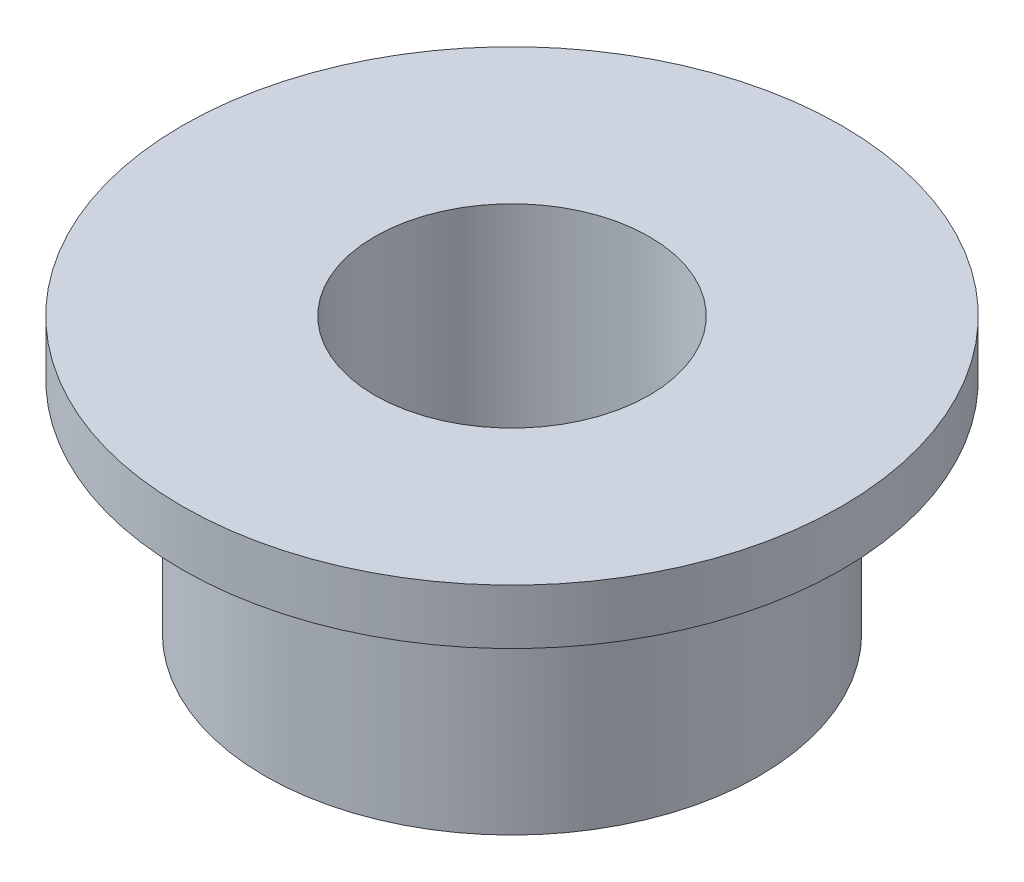
ISO-10303-21;
HEADER;
FILE_DESCRIPTION(('STEP AP214'),'2;1');
FILE_NAME('part.step','',(''),(''),'','','');
FILE_SCHEMA(('AUTOMOTIVE_DESIGN { 1 0 10303 214 1 1 1 1 }'));
ENDSEC;
DATA;
#1=APPLICATION_CONTEXT('core data for automotive mechanical design processes');
#2=APPLICATION_PROTOCOL_DEFINITION('international standard','automotive_design',2000,#1);
#3=PRODUCT_CONTEXT('',#1,'mechanical');
#4=PRODUCT('Part','Part','',(#3));
#5=PRODUCT_RELATED_PRODUCT_CATEGORY('part','',(#4));
#6=PRODUCT_DEFINITION_FORMATION('','',#4);
#7=PRODUCT_DEFINITION_CONTEXT('part definition',#1,'design');
#8=PRODUCT_DEFINITION('design','',#6,#7);
#9=PRODUCT_DEFINITION_SHAPE('','',#8);
#10=(LENGTH_UNIT() NAMED_UNIT(*) SI_UNIT(.MILLI.,.METRE.));
#11=(NAMED_UNIT(*) PLANE_ANGLE_UNIT() SI_UNIT($,.RADIAN.));
#12=(NAMED_UNIT(*) SI_UNIT($,.STERADIAN.) SOLID_ANGLE_UNIT());
#13=UNCERTAINTY_MEASURE_WITH_UNIT(LENGTH_MEASURE(1.E-05),#10,'distance_accuracy_value','');
#14=(GEOMETRIC_REPRESENTATION_CONTEXT(3) GLOBAL_UNCERTAINTY_ASSIGNED_CONTEXT((#13)) GLOBAL_UNIT_ASSIGNED_CONTEXT((#10,
#11,#12)) REPRESENTATION_CONTEXT('',''));
#15=CARTESIAN_POINT('',(0.,0.,0.));
#16=DIRECTION('',(0.,0.,1.));
#17=DIRECTION('',(1.,0.,0.));
#18=AXIS2_PLACEMENT_3D('',#15,#16,#17);
#19=CARTESIAN_POINT('',(0.,0.,-45.));
#20=DIRECTION('',(0.,-1.,0.));
#21=DIRECTION('',(0.,0.,-1.));
#22=AXIS2_PLACEMENT_3D('',#19,#20,#21);
#23=PLANE('',#22);
#24=CARTESIAN_POINT('',(0.,0.,0.));
#25=DIRECTION('',(0.,-1.,0.));
#26=DIRECTION('',(0.,0.,-1.));
#27=AXIS2_PLACEMENT_3D('',#24,#25,#26);
#28=CIRCLE('',#27,45.);
#29=CARTESIAN_POINT('',(0.,0.,-45.));
#30=VERTEX_POINT('',#29);
#31=EDGE_CURVE('E64',#30,#30,#28,.T.);
#32=ORIENTED_EDGE('',*,*,#31,.T.);
#33=EDGE_LOOP('',(#32));
#34=FACE_BOUND('',#33,.T.);
#35=CARTESIAN_POINT('',(0.,0.,0.));
#36=DIRECTION('',(0.,-1.,0.));
#37=DIRECTION('',(0.,0.,-1.));
#38=AXIS2_PLACEMENT_3D('',#35,#36,#37);
#39=CIRCLE('',#38,25.);
#40=CARTESIAN_POINT('',(0.,0.,-25.));
#41=VERTEX_POINT('',#40);
#42=EDGE_CURVE('E10',#41,#41,#39,.T.);
#43=ORIENTED_EDGE('',*,*,#42,.F.);
#44=EDGE_LOOP('',(#43));
#45=FACE_BOUND('',#44,.T.);
#46=ADVANCED_FACE('F37',(#34,#45),#23,.T.);
#47=CARTESIAN_POINT('',(0.,0.,0.));
#48=DIRECTION('',(0.,-1.,0.));
#49=DIRECTION('',(0.,0.,-1.));
#50=AXIS2_PLACEMENT_3D('',#47,#48,#49);
#51=CYLINDRICAL_SURFACE('',#50,25.);
#52=ORIENTED_EDGE('',*,*,#42,.T.);
#53=EDGE_LOOP('',(#52));
#54=FACE_BOUND('',#53,.T.);
#55=CARTESIAN_POINT('',(0.,50.,0.));
#56=DIRECTION('',(0.,-1.,0.));
#57=DIRECTION('',(0.,0.,-1.));
#58=AXIS2_PLACEMENT_3D('',#55,#56,#57);
#59=CIRCLE('',#58,25.);
#60=CARTESIAN_POINT('',(0.,50.,-25.));
#61=VERTEX_POINT('',#60);
#62=EDGE_CURVE('E44',#61,#61,#59,.T.);
#63=ORIENTED_EDGE('',*,*,#62,.F.);
#64=EDGE_LOOP('',(#63));
#65=FACE_BOUND('',#64,.T.);
#66=ADVANCED_FACE('F83',(#54,#65),#51,.F.);
#67=CARTESIAN_POINT('',(0.,50.,-25.));
#68=DIRECTION('',(0.,1.,0.));
#69=DIRECTION('',(0.,0.,1.));
#70=AXIS2_PLACEMENT_3D('',#67,#68,#69);
#71=PLANE('',#70);
#72=ORIENTED_EDGE('',*,*,#62,.T.);
#73=EDGE_LOOP('',(#72));
#74=FACE_BOUND('',#73,.T.);
#75=CARTESIAN_POINT('',(0.,50.,0.));
#76=DIRECTION('',(0.,-1.,0.));
#77=DIRECTION('',(0.,0.,-1.));
#78=AXIS2_PLACEMENT_3D('',#75,#76,#77);
#79=CIRCLE('',#78,60.);
#80=CARTESIAN_POINT('',(0.,50.,-60.));
#81=VERTEX_POINT('',#80);
#82=EDGE_CURVE('E49',#81,#81,#79,.T.);
#83=ORIENTED_EDGE('',*,*,#82,.F.);
#84=EDGE_LOOP('',(#83));
#85=FACE_BOUND('',#84,.T.);
#86=ADVANCED_FACE('F87',(#74,#85),#71,.T.);
#87=CARTESIAN_POINT('',(0.,0.,0.));
#88=DIRECTION('',(0.,-1.,0.));
#89=DIRECTION('',(0.,0.,-1.));
#90=AXIS2_PLACEMENT_3D('',#87,#88,#89);
#91=CYLINDRICAL_SURFACE('',#90,60.);
#92=ORIENTED_EDGE('',*,*,#82,.T.);
#93=EDGE_LOOP('',(#92));
#94=FACE_BOUND('',#93,.T.);
#95=CARTESIAN_POINT('',(0.,40.,0.));
#96=DIRECTION('',(0.,-1.,0.));
#97=DIRECTION('',(0.,0.,-1.));
#98=AXIS2_PLACEMENT_3D('',#95,#96,#97);
#99=CIRCLE('',#98,60.);
#100=CARTESIAN_POINT('',(0.,40.,-60.));
#101=VERTEX_POINT('',#100);
#102=EDGE_CURVE('E54',#101,#101,#99,.T.);
#103=ORIENTED_EDGE('',*,*,#102,.F.);
#104=EDGE_LOOP('',(#103));
#105=FACE_BOUND('',#104,.T.);
#106=ADVANCED_FACE('F79',(#94,#105),#91,.T.);
#107=CARTESIAN_POINT('',(0.,40.,-60.));
#108=DIRECTION('',(0.,-1.,0.));
#109=DIRECTION('',(0.,0.,-1.));
#110=AXIS2_PLACEMENT_3D('',#107,#108,#109);
#111=PLANE('',#110);
#112=ORIENTED_EDGE('',*,*,#102,.T.);
#113=EDGE_LOOP('',(#112));
#114=FACE_BOUND('',#113,.T.);
#115=CARTESIAN_POINT('',(0.,40.,0.));
#116=DIRECTION('',(0.,-1.,0.));
#117=DIRECTION('',(0.,0.,-1.));
#118=AXIS2_PLACEMENT_3D('',#115,#116,#117);
#119=CIRCLE('',#118,45.);
#120=CARTESIAN_POINT('',(0.,40.,-45.));
#121=VERTEX_POINT('',#120);
#122=EDGE_CURVE('E60',#121,#121,#119,.T.);
#123=ORIENTED_EDGE('',*,*,#122,.F.);
#124=EDGE_LOOP('',(#123));
#125=FACE_BOUND('',#124,.T.);
#126=ADVANCED_FACE('F73',(#114,#125),#111,.T.);
#127=CARTESIAN_POINT('',(0.,0.,0.));
#128=DIRECTION('',(0.,-1.,0.));
#129=DIRECTION('',(0.,0.,-1.));
#130=AXIS2_PLACEMENT_3D('',#127,#128,#129);
#131=CYLINDRICAL_SURFACE('',#130,45.);
#132=ORIENTED_EDGE('',*,*,#122,.T.);
#133=EDGE_LOOP('',(#132));
#134=FACE_BOUND('',#133,.T.);
#135=ORIENTED_EDGE('',*,*,#31,.F.);
#136=EDGE_LOOP('',(#135));
#137=FACE_BOUND('',#136,.T.);
#138=ADVANCED_FACE('F71',(#134,#137),#131,.T.);
#139=CLOSED_SHELL('',(#46,#66,#86,#106,#126,#138));
#140=MANIFOLD_SOLID_BREP('B2',#139);
#141=ADVANCED_BREP_SHAPE_REPRESENTATION('',(#18,#140),#14);
#142=SHAPE_DEFINITION_REPRESENTATION(#9,#141);
ENDSEC;
END-ISO-10303-21;
